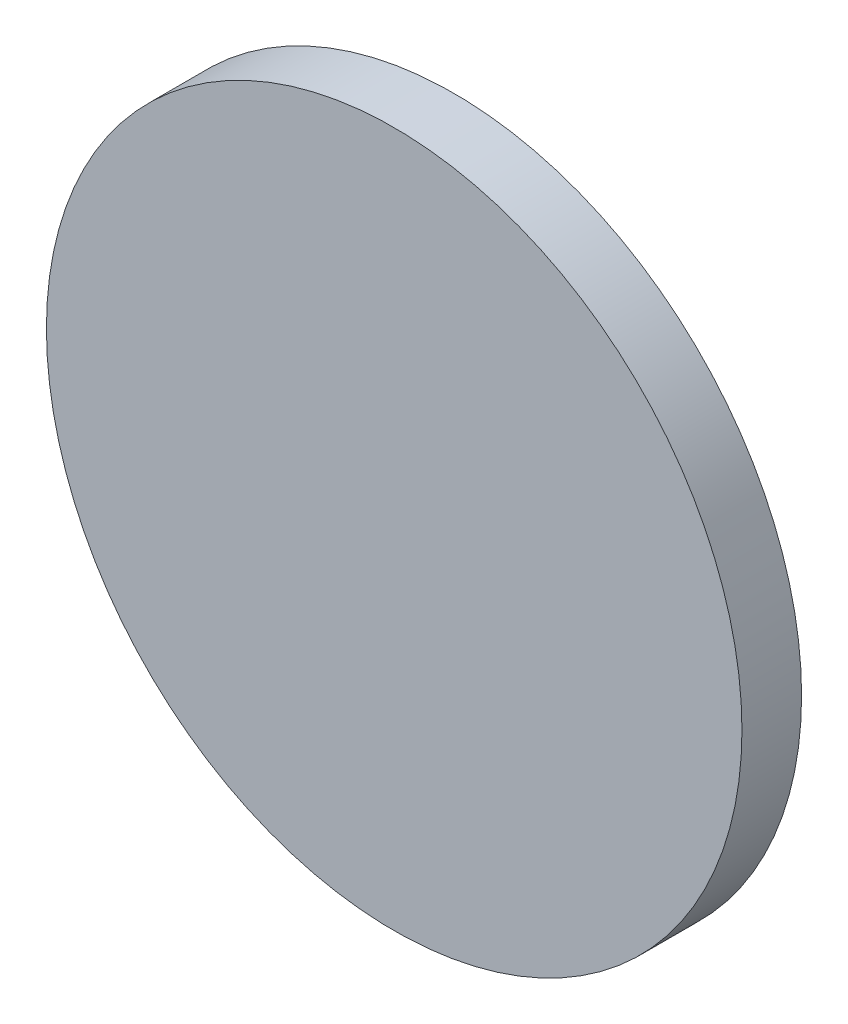
ISO-10303-21;
HEADER;
FILE_DESCRIPTION(('STEP AP214'),'2;1');
FILE_NAME('part.step','',(''),(''),'','','');
FILE_SCHEMA(('AUTOMOTIVE_DESIGN { 1 0 10303 214 1 1 1 1 }'));
ENDSEC;
DATA;
#1=APPLICATION_CONTEXT('core data for automotive mechanical design processes');
#2=APPLICATION_PROTOCOL_DEFINITION('international standard','automotive_design',2000,#1);
#3=PRODUCT_CONTEXT('',#1,'mechanical');
#4=PRODUCT('Part','Part','',(#3));
#5=PRODUCT_RELATED_PRODUCT_CATEGORY('part','',(#4));
#6=PRODUCT_DEFINITION_FORMATION('','',#4);
#7=PRODUCT_DEFINITION_CONTEXT('part definition',#1,'design');
#8=PRODUCT_DEFINITION('design','',#6,#7);
#9=PRODUCT_DEFINITION_SHAPE('','',#8);
#10=(LENGTH_UNIT() NAMED_UNIT(*) SI_UNIT(.MILLI.,.METRE.));
#11=(NAMED_UNIT(*) PLANE_ANGLE_UNIT() SI_UNIT($,.RADIAN.));
#12=(NAMED_UNIT(*) SI_UNIT($,.STERADIAN.) SOLID_ANGLE_UNIT());
#13=UNCERTAINTY_MEASURE_WITH_UNIT(LENGTH_MEASURE(1.E-05),#10,'distance_accuracy_value','');
#14=(GEOMETRIC_REPRESENTATION_CONTEXT(3) GLOBAL_UNCERTAINTY_ASSIGNED_CONTEXT((#13)) GLOBAL_UNIT_ASSIGNED_CONTEXT((#10,
#11,#12)) REPRESENTATION_CONTEXT('',''));
#15=CARTESIAN_POINT('',(0.,0.,0.));
#16=DIRECTION('',(0.,0.,1.));
#17=DIRECTION('',(1.,0.,0.));
#18=AXIS2_PLACEMENT_3D('',#15,#16,#17);
#19=CARTESIAN_POINT('',(11.90008,10.900000014875,0.76487));
#20=DIRECTION('',(0.,0.,-1.));
#21=DIRECTION('',(-1.,0.,0.));
#22=AXIS2_PLACEMENT_3D('',#19,#20,#21);
#23=PLANE('',#22);
#24=CARTESIAN_POINT('',(11.90008,10.900000014875,0.76487));
#25=DIRECTION('',(0.,0.,1.));
#26=DIRECTION('',(1.,0.,0.));
#27=AXIS2_PLACEMENT_3D('',#24,#25,#26);
#28=CIRCLE('',#27,0.200024667);
#29=CARTESIAN_POINT('',(12.100104667,10.900000014875,0.76487));
#30=VERTEX_POINT('',#29);
#31=EDGE_CURVE('E18',#30,#30,#28,.T.);
#32=ORIENTED_EDGE('',*,*,#31,.F.);
#33=EDGE_LOOP('',(#32));
#34=FACE_BOUND('',#33,.T.);
#35=ADVANCED_FACE('F15',(#34),#23,.T.);
#36=CARTESIAN_POINT('',(11.90008,10.900000014875,0.76487));
#37=DIRECTION('',(0.,0.,1.));
#38=DIRECTION('',(1.,0.,0.));
#39=AXIS2_PLACEMENT_3D('',#36,#37,#38);
#40=CYLINDRICAL_SURFACE('',#39,0.200024667);
#41=CARTESIAN_POINT('',(11.90008,10.900000014875,0.79916));
#42=DIRECTION('',(0.,0.,1.));
#43=DIRECTION('',(1.,0.,0.));
#44=AXIS2_PLACEMENT_3D('',#41,#42,#43);
#45=CIRCLE('',#44,0.200024667);
#46=CARTESIAN_POINT('',(12.100104667,10.900000014875,0.79916));
#47=VERTEX_POINT('',#46);
#48=EDGE_CURVE('E10',#47,#47,#45,.T.);
#49=ORIENTED_EDGE('',*,*,#48,.F.);
#50=EDGE_LOOP('',(#49));
#51=FACE_BOUND('',#50,.T.);
#52=ORIENTED_EDGE('',*,*,#31,.T.);
#53=EDGE_LOOP('',(#52));
#54=FACE_BOUND('',#53,.T.);
#55=ADVANCED_FACE('F27',(#51,#54),#40,.T.);
#56=CARTESIAN_POINT('',(11.90008,10.900000014875,0.79916));
#57=DIRECTION('',(0.,0.,1.));
#58=DIRECTION('',(1.,0.,0.));
#59=AXIS2_PLACEMENT_3D('',#56,#57,#58);
#60=PLANE('',#59);
#61=ORIENTED_EDGE('',*,*,#48,.T.);
#62=EDGE_LOOP('',(#61));
#63=FACE_BOUND('',#62,.T.);
#64=ADVANCED_FACE('F34',(#63),#60,.T.);
#65=CLOSED_SHELL('',(#35,#55,#64));
#66=MANIFOLD_SOLID_BREP('B1',#65);
#67=ADVANCED_BREP_SHAPE_REPRESENTATION('',(#18,#66),#14);
#68=SHAPE_DEFINITION_REPRESENTATION(#9,#67);
ENDSEC;
END-ISO-10303-21;
